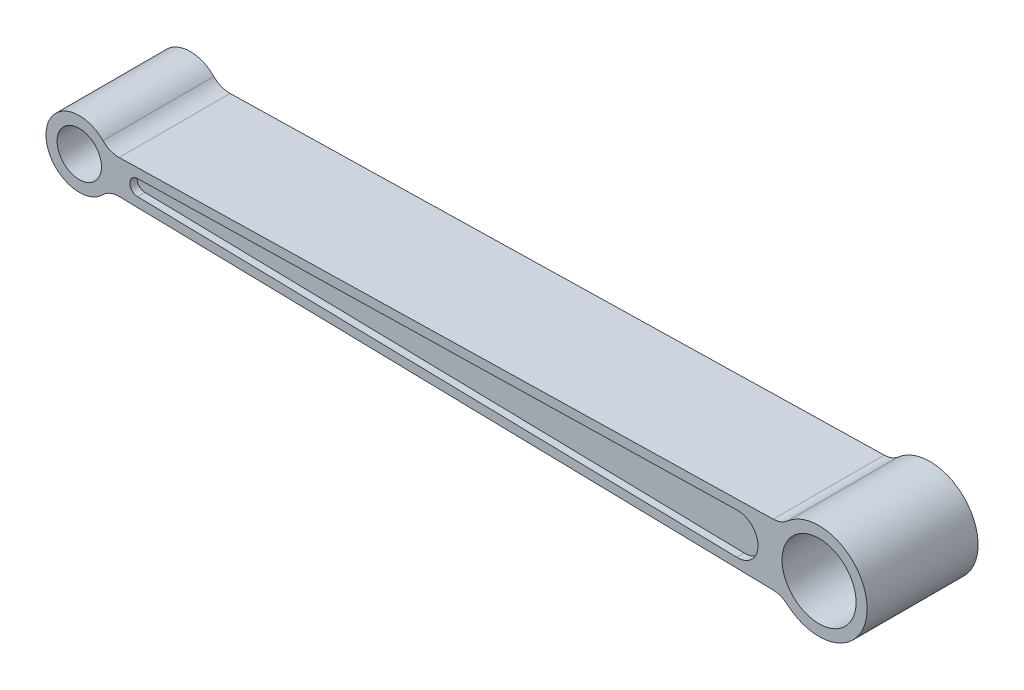
ISO-10303-21;
HEADER;
FILE_DESCRIPTION(('STEP AP214'),'2;1');
FILE_NAME('part.step','',(''),(''),'','','');
FILE_SCHEMA(('AUTOMOTIVE_DESIGN { 1 0 10303 214 1 1 1 1 }'));
ENDSEC;
DATA;
#1=APPLICATION_CONTEXT('core data for automotive mechanical design processes');
#2=APPLICATION_PROTOCOL_DEFINITION('international standard','automotive_design',2000,#1);
#3=PRODUCT_CONTEXT('',#1,'mechanical');
#4=PRODUCT('Part','Part','',(#3));
#5=PRODUCT_RELATED_PRODUCT_CATEGORY('part','',(#4));
#6=PRODUCT_DEFINITION_FORMATION('','',#4);
#7=PRODUCT_DEFINITION_CONTEXT('part definition',#1,'design');
#8=PRODUCT_DEFINITION('design','',#6,#7);
#9=PRODUCT_DEFINITION_SHAPE('','',#8);
#10=(LENGTH_UNIT() NAMED_UNIT(*) SI_UNIT(.MILLI.,.METRE.));
#11=(NAMED_UNIT(*) PLANE_ANGLE_UNIT() SI_UNIT($,.RADIAN.));
#12=(NAMED_UNIT(*) SI_UNIT($,.STERADIAN.) SOLID_ANGLE_UNIT());
#13=UNCERTAINTY_MEASURE_WITH_UNIT(LENGTH_MEASURE(1.E-05),#10,'distance_accuracy_value','');
#14=(GEOMETRIC_REPRESENTATION_CONTEXT(3) GLOBAL_UNCERTAINTY_ASSIGNED_CONTEXT((#13)) GLOBAL_UNIT_ASSIGNED_CONTEXT((#10,
#11,#12)) REPRESENTATION_CONTEXT('',''));
#15=CARTESIAN_POINT('',(0.,0.,0.));
#16=DIRECTION('',(0.,0.,1.));
#17=DIRECTION('',(1.,0.,0.));
#18=AXIS2_PLACEMENT_3D('',#15,#16,#17);
#19=CARTESIAN_POINT('',(-0.0188833196937545,-0.892432260097631,7.5));
#20=DIRECTION('',(0.0211546519999597,0.999776215309586,0.));
#21=DIRECTION('',(-0.999776215309586,0.0211546519999597,0.));
#22=AXIS2_PLACEMENT_3D('',#19,#20,#21);
#23=PLANE('',#22);
#24=DIRECTION('',(0.,0.,-1.));
#25=VECTOR('',#24,1.);
#26=CARTESIAN_POINT('',(7.88368043257852,-1.05964566598472,7.5));
#27=LINE('',#26,#25);
#28=CARTESIAN_POINT('',(7.88368043257852,-1.05964566598472,-6.5));
#29=VERTEX_POINT('',#28);
#30=CARTESIAN_POINT('',(7.88368043257852,-1.05964566598472,-7.5));
#31=VERTEX_POINT('',#30);
#32=EDGE_CURVE('E274',#29,#31,#27,.T.);
#33=ORIENTED_EDGE('',*,*,#32,.F.);
#34=DIRECTION('',(0.999776215309587,-0.0211546519999597,0.));
#35=VECTOR('',#34,1.);
#36=CARTESIAN_POINT('',(-0.0188833196937545,-0.892432260097631,-6.5));
#37=LINE('',#36,#35);
#38=CARTESIAN_POINT('',(88.8559527051768,-2.77296932316172,-6.5));
#39=VERTEX_POINT('',#38);
#40=EDGE_CURVE('E197',#29,#39,#37,.T.);
#41=ORIENTED_EDGE('',*,*,#40,.T.);
#42=DIRECTION('',(0.,0.,-1.));
#43=VECTOR('',#42,1.);
#44=CARTESIAN_POINT('',(88.8559527051768,-2.77296932316172,7.5));
#45=LINE('',#44,#43);
#46=CARTESIAN_POINT('',(88.8559527051768,-2.77296932316172,-7.5));
#47=VERTEX_POINT('',#46);
#48=EDGE_CURVE('E278',#39,#47,#45,.T.);
#49=ORIENTED_EDGE('',*,*,#48,.T.);
#50=DIRECTION('',(0.999776215309587,-0.0211546519999597,0.));
#51=VECTOR('',#50,1.);
#52=CARTESIAN_POINT('',(-0.0188833196937545,-0.892432260097631,-7.5));
#53=LINE('',#52,#51);
#54=EDGE_CURVE('E240',#31,#47,#53,.T.);
#55=ORIENTED_EDGE('',*,*,#54,.F.);
#56=EDGE_LOOP('',(#33,#41,#49,#55));
#57=FACE_BOUND('',#56,.T.);
#58=ADVANCED_FACE('F38',(#57),#23,.T.);
#59=CARTESIAN_POINT('',(7.88368043257851,0.,7.5));
#60=DIRECTION('',(0.,0.,-1.));
#61=DIRECTION('',(-1.,0.,0.));
#62=AXIS2_PLACEMENT_3D('',#59,#60,#61);
#63=CYLINDRICAL_SURFACE('',#62,1.05964566598483);
#64=DIRECTION('',(0.,0.,-1.));
#65=VECTOR('',#64,1.);
#66=CARTESIAN_POINT('',(7.88368043257851,1.05964566598495,7.5));
#67=LINE('',#66,#65);
#68=CARTESIAN_POINT('',(7.88368043257851,1.05964566598495,-6.5));
#69=VERTEX_POINT('',#68);
#70=CARTESIAN_POINT('',(7.88368043257851,1.05964566598495,-7.5));
#71=VERTEX_POINT('',#70);
#72=EDGE_CURVE('E269',#69,#71,#67,.T.);
#73=ORIENTED_EDGE('',*,*,#72,.F.);
#74=CARTESIAN_POINT('',(7.88368043257851,0.,-6.5));
#75=DIRECTION('',(0.,0.,1.));
#76=DIRECTION('',(1.,0.,0.));
#77=AXIS2_PLACEMENT_3D('',#74,#75,#76);
#78=CIRCLE('',#77,1.05964566598483);
#79=EDGE_CURVE('E175',#69,#29,#78,.T.);
#80=ORIENTED_EDGE('',*,*,#79,.T.);
#81=ORIENTED_EDGE('',*,*,#32,.T.);
#82=CARTESIAN_POINT('',(7.88368043257851,0.,-7.5));
#83=DIRECTION('',(0.,0.,1.));
#84=DIRECTION('',(1.,0.,0.));
#85=AXIS2_PLACEMENT_3D('',#82,#83,#84);
#86=CIRCLE('',#85,1.05964566598483);
#87=EDGE_CURVE('E243',#71,#31,#86,.T.);
#88=ORIENTED_EDGE('',*,*,#87,.F.);
#89=EDGE_LOOP('',(#73,#80,#81,#88));
#90=FACE_BOUND('',#89,.T.);
#91=ADVANCED_FACE('F359',(#90),#63,.F.);
#92=CARTESIAN_POINT('',(-0.0188833196937573,0.892432260097883,7.5));
#93=DIRECTION('',(-0.0211546519999568,0.999776215309586,0.));
#94=DIRECTION('',(-0.999776215309586,-0.0211546519999568,0.));
#95=AXIS2_PLACEMENT_3D('',#92,#93,#94);
#96=PLANE('',#95);
#97=DIRECTION('',(0.999776215309587,0.0211546519999568,0.));
#98=VECTOR('',#97,1.);
#99=CARTESIAN_POINT('',(-0.0188833196937573,0.892432260097883,-6.5));
#100=LINE('',#99,#98);
#101=CARTESIAN_POINT('',(88.8559527051768,2.77296932316172,-6.5));
#102=VERTEX_POINT('',#101);
#103=EDGE_CURVE('E202',#69,#102,#100,.T.);
#104=ORIENTED_EDGE('',*,*,#103,.F.);
#105=ORIENTED_EDGE('',*,*,#72,.T.);
#106=DIRECTION('',(0.999776215309587,0.0211546519999568,0.));
#107=VECTOR('',#106,1.);
#108=CARTESIAN_POINT('',(-0.0188833196937573,0.892432260097883,-7.5));
#109=LINE('',#108,#107);
#110=CARTESIAN_POINT('',(88.8559527051768,2.77296932316172,-7.5));
#111=VERTEX_POINT('',#110);
#112=EDGE_CURVE('E246',#71,#111,#109,.T.);
#113=ORIENTED_EDGE('',*,*,#112,.T.);
#114=DIRECTION('',(0.,0.,-1.));
#115=VECTOR('',#114,1.);
#116=CARTESIAN_POINT('',(88.8559527051768,2.77296932316172,7.5));
#117=LINE('',#116,#115);
#118=EDGE_CURVE('E237',#102,#111,#117,.T.);
#119=ORIENTED_EDGE('',*,*,#118,.F.);
#120=EDGE_LOOP('',(#104,#105,#113,#119));
#121=FACE_BOUND('',#120,.T.);
#122=ADVANCED_FACE('F366',(#121),#96,.F.);
#123=CARTESIAN_POINT('',(-0.0458432814275866,-2.16656943367056,7.5));
#124=DIRECTION('',(0.0211546519999571,0.999776215309586,0.));
#125=DIRECTION('',(-0.999776215309586,0.0211546519999571,0.));
#126=AXIS2_PLACEMENT_3D('',#123,#124,#125);
#127=PLANE('',#126);
#128=DIRECTION('',(0.999776215309587,-0.0211546519999571,0.));
#129=VECTOR('',#128,1.);
#130=CARTESIAN_POINT('',(-0.0458432814275866,-2.16656943367056,-7.5));
#131=LINE('',#130,#129);
#132=CARTESIAN_POINT('',(5.38907383574148,-2.28156894906383,-7.5));
#133=VERTEX_POINT('',#132);
#134=CARTESIAN_POINT('',(93.8103676454789,-4.15250933681024,-7.5));
#135=VERTEX_POINT('',#134);
#136=EDGE_CURVE('E249',#133,#135,#131,.T.);
#137=ORIENTED_EDGE('',*,*,#136,.T.);
#138=DIRECTION('',(0.,0.,1.));
#139=VECTOR('',#138,1.);
#140=CARTESIAN_POINT('',(93.8103676454788,-4.15250933681024,7.5));
#141=LINE('',#140,#139);
#142=CARTESIAN_POINT('',(93.8103676454789,-4.15250933681024,7.5));
#143=VERTEX_POINT('',#142);
#144=EDGE_CURVE('E290',#135,#143,#141,.T.);
#145=ORIENTED_EDGE('',*,*,#144,.T.);
#146=DIRECTION('',(0.999776215309587,-0.0211546519999571,0.));
#147=VECTOR('',#146,1.);
#148=CARTESIAN_POINT('',(-0.0458432814275866,-2.16656943367056,7.5));
#149=LINE('',#148,#147);
#150=CARTESIAN_POINT('',(5.38907383574148,-2.28156894906383,7.5));
#151=VERTEX_POINT('',#150);
#152=EDGE_CURVE('E221',#151,#143,#149,.T.);
#153=ORIENTED_EDGE('',*,*,#152,.F.);
#154=DIRECTION('',(0.,0.,1.));
#155=VECTOR('',#154,1.);
#156=CARTESIAN_POINT('',(5.38907383574148,-2.28156894906383,-7.5));
#157=LINE('',#156,#155);
#158=EDGE_CURVE('E287',#151,#133,#157,.F.);
#159=ORIENTED_EDGE('',*,*,#158,.T.);
#160=EDGE_LOOP('',(#137,#145,#153,#159));
#161=FACE_BOUND('',#160,.T.);
#162=ADVANCED_FACE('F342',(#161),#127,.F.);
#163=CARTESIAN_POINT('',(100.,0.,7.5));
#164=DIRECTION('',(0.,0.,-1.));
#165=DIRECTION('',(-1.,0.,0.));
#166=AXIS2_PLACEMENT_3D('',#163,#164,#165);
#167=CYLINDRICAL_SURFACE('',#166,6.5);
#168=CARTESIAN_POINT('',(100.,0.,7.5));
#169=DIRECTION('',(0.,0.,1.));
#170=DIRECTION('',(1.,0.,0.));
#171=AXIS2_PLACEMENT_3D('',#168,#169,#170);
#172=CIRCLE('',#171,6.5);
#173=CARTESIAN_POINT('',(95.7215656822751,-4.8933628302951,7.5));
#174=VERTEX_POINT('',#173);
#175=CARTESIAN_POINT('',(95.7215656822751,4.8933628302951,7.5));
#176=VERTEX_POINT('',#175);
#177=EDGE_CURVE('E224',#174,#176,#172,.T.);
#178=ORIENTED_EDGE('',*,*,#177,.F.);
#179=DIRECTION('',(0.,0.,-1.));
#180=VECTOR('',#179,1.);
#181=CARTESIAN_POINT('',(95.7215656822751,-4.8933628302951,7.5));
#182=LINE('',#181,#180);
#183=CARTESIAN_POINT('',(95.7215656822751,-4.8933628302951,-7.5));
#184=VERTEX_POINT('',#183);
#185=EDGE_CURVE('E284',#174,#184,#182,.T.);
#186=ORIENTED_EDGE('',*,*,#185,.T.);
#187=CARTESIAN_POINT('',(100.,0.,-7.5));
#188=DIRECTION('',(0.,0.,1.));
#189=DIRECTION('',(1.,0.,0.));
#190=AXIS2_PLACEMENT_3D('',#187,#188,#189);
#191=CIRCLE('',#190,6.5);
#192=CARTESIAN_POINT('',(95.7215656822751,4.8933628302951,-7.5));
#193=VERTEX_POINT('',#192);
#194=EDGE_CURVE('E252',#184,#193,#191,.T.);
#195=ORIENTED_EDGE('',*,*,#194,.T.);
#196=DIRECTION('',(0.,0.,-1.));
#197=VECTOR('',#196,1.);
#198=CARTESIAN_POINT('',(95.7215656822751,4.8933628302951,7.5));
#199=LINE('',#198,#197);
#200=EDGE_CURVE('E282',#193,#176,#199,.F.);
#201=ORIENTED_EDGE('',*,*,#200,.T.);
#202=EDGE_LOOP('',(#178,#186,#195,#201));
#203=FACE_BOUND('',#202,.T.);
#204=ADVANCED_FACE('F322',(#203),#167,.T.);
#205=CARTESIAN_POINT('',(-0.0458432814275862,2.16656943367057,7.5));
#206=DIRECTION('',(-0.0211546519999569,0.999776215309586,0.));
#207=DIRECTION('',(-0.999776215309586,-0.0211546519999569,0.));
#208=AXIS2_PLACEMENT_3D('',#205,#206,#207);
#209=PLANE('',#208);
#210=DIRECTION('',(0.999776215309587,0.0211546519999569,0.));
#211=VECTOR('',#210,1.);
#212=CARTESIAN_POINT('',(-0.0458432814275862,2.16656943367057,-7.5));
#213=LINE('',#212,#211);
#214=CARTESIAN_POINT('',(5.38907383574148,2.28156894906384,-7.5));
#215=VERTEX_POINT('',#214);
#216=CARTESIAN_POINT('',(93.8103676454788,4.15250933681022,-7.5));
#217=VERTEX_POINT('',#216);
#218=EDGE_CURVE('E255',#215,#217,#213,.T.);
#219=ORIENTED_EDGE('',*,*,#218,.F.);
#220=DIRECTION('',(0.,0.,-1.));
#221=VECTOR('',#220,1.);
#222=CARTESIAN_POINT('',(5.38907383574148,2.28156894906384,7.5));
#223=LINE('',#222,#221);
#224=CARTESIAN_POINT('',(5.38907383574148,2.28156894906384,7.5));
#225=VERTEX_POINT('',#224);
#226=EDGE_CURVE('E58',#215,#225,#223,.F.);
#227=ORIENTED_EDGE('',*,*,#226,.T.);
#228=DIRECTION('',(0.999776215309587,0.0211546519999569,0.));
#229=VECTOR('',#228,1.);
#230=CARTESIAN_POINT('',(-0.0458432814275862,2.16656943367057,7.5));
#231=LINE('',#230,#229);
#232=CARTESIAN_POINT('',(93.8103676454788,4.15250933681022,7.5));
#233=VERTEX_POINT('',#232);
#234=EDGE_CURVE('E226',#225,#233,#231,.T.);
#235=ORIENTED_EDGE('',*,*,#234,.T.);
#236=DIRECTION('',(0.,0.,-1.));
#237=VECTOR('',#236,1.);
#238=CARTESIAN_POINT('',(93.8103676454788,4.15250933681022,7.5));
#239=LINE('',#238,#237);
#240=EDGE_CURVE('E297',#233,#217,#239,.T.);
#241=ORIENTED_EDGE('',*,*,#240,.T.);
#242=EDGE_LOOP('',(#219,#227,#235,#241));
#243=FACE_BOUND('',#242,.T.);
#244=ADVANCED_FACE('F324',(#243),#209,.T.);
#245=CARTESIAN_POINT('',(88.9733539309243,0.,7.5));
#246=DIRECTION('',(0.,0.,-1.));
#247=DIRECTION('',(-1.,0.,0.));
#248=AXIS2_PLACEMENT_3D('',#245,#246,#247);
#249=CYLINDRICAL_SURFACE('',#248,2.77545346114882);
#250=CARTESIAN_POINT('',(88.9733539309243,0.,6.5));
#251=DIRECTION('',(0.,0.,1.));
#252=DIRECTION('',(1.,0.,0.));
#253=AXIS2_PLACEMENT_3D('',#250,#251,#252);
#254=CIRCLE('',#253,2.77545346114882);
#255=CARTESIAN_POINT('',(88.9733539309242,-2.77545346114882,6.5));
#256=VERTEX_POINT('',#255);
#257=CARTESIAN_POINT('',(88.9733539309242,2.77545346114882,6.5));
#258=VERTEX_POINT('',#257);
#259=EDGE_CURVE('E169',#256,#258,#254,.T.);
#260=ORIENTED_EDGE('',*,*,#259,.F.);
#261=DIRECTION('',(0.,0.,-1.));
#262=VECTOR('',#261,1.);
#263=CARTESIAN_POINT('',(88.9733539309242,-2.77545346114882,6.5));
#264=LINE('',#263,#262);
#265=CARTESIAN_POINT('',(88.9733539309242,-2.77545346114882,-6.5));
#266=VERTEX_POINT('',#265);
#267=EDGE_CURVE('E178',#256,#266,#264,.T.);
#268=ORIENTED_EDGE('',*,*,#267,.T.);
#269=CARTESIAN_POINT('',(88.9733539309243,0.,-6.5));
#270=DIRECTION('',(0.,0.,1.));
#271=DIRECTION('',(1.,0.,0.));
#272=AXIS2_PLACEMENT_3D('',#269,#270,#271);
#273=CIRCLE('',#272,2.77545346114882);
#274=CARTESIAN_POINT('',(88.973353930924,2.77545346114882,-6.5));
#275=VERTEX_POINT('',#274);
#276=EDGE_CURVE('E199',#266,#275,#273,.T.);
#277=ORIENTED_EDGE('',*,*,#276,.T.);
#278=DIRECTION('',(0.,0.,-1.));
#279=VECTOR('',#278,1.);
#280=CARTESIAN_POINT('',(88.9733539309242,2.77545346114882,6.5));
#281=LINE('',#280,#279);
#282=EDGE_CURVE('E186',#258,#275,#281,.T.);
#283=ORIENTED_EDGE('',*,*,#282,.F.);
#284=EDGE_LOOP('',(#260,#268,#277,#283));
#285=FACE_BOUND('',#284,.T.);
#286=CARTESIAN_POINT('',(88.9733539309243,0.,-7.5));
#287=DIRECTION('',(0.,0.,1.));
#288=DIRECTION('',(1.,0.,0.));
#289=AXIS2_PLACEMENT_3D('',#286,#287,#288);
#290=CIRCLE('',#289,2.77545346114882);
#291=EDGE_CURVE('E208',#47,#111,#290,.T.);
#292=ORIENTED_EDGE('',*,*,#291,.F.);
#293=ORIENTED_EDGE('',*,*,#48,.F.);
#294=DIRECTION('',(0.,0.,-1.));
#295=VECTOR('',#294,1.);
#296=CARTESIAN_POINT('',(88.8559527051768,-2.77296932316172,7.5));
#297=LINE('',#296,#295);
#298=CARTESIAN_POINT('',(88.8559527051768,-2.77296932316172,6.5));
#299=VERTEX_POINT('',#298);
#300=EDGE_CURVE('E185',#39,#299,#297,.F.);
#301=ORIENTED_EDGE('',*,*,#300,.T.);
#302=CARTESIAN_POINT('',(88.8559527051768,-2.77296932316172,7.5));
#303=VERTEX_POINT('',#302);
#304=EDGE_CURVE('E279',#303,#299,#45,.T.);
#305=ORIENTED_EDGE('',*,*,#304,.F.);
#306=CARTESIAN_POINT('',(88.9733539309243,0.,7.5));
#307=DIRECTION('',(0.,0.,1.));
#308=DIRECTION('',(1.,0.,0.));
#309=AXIS2_PLACEMENT_3D('',#306,#307,#308);
#310=CIRCLE('',#309,2.77545346114882);
#311=CARTESIAN_POINT('',(88.8559527051768,2.77296932316172,7.5));
#312=VERTEX_POINT('',#311);
#313=EDGE_CURVE('E209',#303,#312,#310,.T.);
#314=ORIENTED_EDGE('',*,*,#313,.T.);
#315=CARTESIAN_POINT('',(88.8559527051768,2.77296932316172,6.5));
#316=VERTEX_POINT('',#315);
#317=EDGE_CURVE('E266',#312,#316,#117,.T.);
#318=ORIENTED_EDGE('',*,*,#317,.T.);
#319=EDGE_CURVE('E270',#316,#102,#117,.T.);
#320=ORIENTED_EDGE('',*,*,#319,.T.);
#321=ORIENTED_EDGE('',*,*,#118,.T.);
#322=EDGE_LOOP('',(#292,#293,#301,#305,#314,#318,#320,#321));
#323=FACE_BOUND('',#322,.T.);
#324=ADVANCED_FACE('F188',(#285,#323),#249,.F.);
#325=DIRECTION('',(0.999776215309587,-0.0211546519999597,0.));
#326=VECTOR('',#325,1.);
#327=CARTESIAN_POINT('',(-0.0188833196937545,-0.892432260097631,6.5));
#328=LINE('',#327,#326);
#329=CARTESIAN_POINT('',(7.88368043257852,-1.05964566598472,6.5));
#330=VERTEX_POINT('',#329);
#331=EDGE_CURVE('E172',#330,#299,#328,.T.);
#332=ORIENTED_EDGE('',*,*,#331,.F.);
#333=CARTESIAN_POINT('',(7.88368043257852,-1.05964566598472,7.5));
#334=VERTEX_POINT('',#333);
#335=EDGE_CURVE('E275',#334,#330,#27,.T.);
#336=ORIENTED_EDGE('',*,*,#335,.F.);
#337=DIRECTION('',(0.999776215309587,-0.0211546519999597,0.));
#338=VECTOR('',#337,1.);
#339=CARTESIAN_POINT('',(-0.0188833196937545,-0.892432260097631,7.5));
#340=LINE('',#339,#338);
#341=EDGE_CURVE('E212',#334,#303,#340,.T.);
#342=ORIENTED_EDGE('',*,*,#341,.T.);
#343=ORIENTED_EDGE('',*,*,#304,.T.);
#344=EDGE_LOOP('',(#332,#336,#342,#343));
#345=FACE_BOUND('',#344,.T.);
#346=ADVANCED_FACE('F362',(#345),#23,.T.);
#347=CARTESIAN_POINT('',(7.88368043257851,0.,6.5));
#348=DIRECTION('',(0.,0.,1.));
#349=DIRECTION('',(1.,0.,0.));
#350=AXIS2_PLACEMENT_3D('',#347,#348,#349);
#351=CIRCLE('',#350,1.05964566598483);
#352=CARTESIAN_POINT('',(7.88368043257851,1.05964566598495,6.5));
#353=VERTEX_POINT('',#352);
#354=EDGE_CURVE('E195',#353,#330,#351,.T.);
#355=ORIENTED_EDGE('',*,*,#354,.F.);
#356=CARTESIAN_POINT('',(7.88368043257851,1.05964566598495,7.5));
#357=VERTEX_POINT('',#356);
#358=EDGE_CURVE('E271',#357,#353,#67,.T.);
#359=ORIENTED_EDGE('',*,*,#358,.F.);
#360=CARTESIAN_POINT('',(7.88368043257851,0.,7.5));
#361=DIRECTION('',(0.,0.,1.));
#362=DIRECTION('',(1.,0.,0.));
#363=AXIS2_PLACEMENT_3D('',#360,#361,#362);
#364=CIRCLE('',#363,1.05964566598483);
#365=EDGE_CURVE('E216',#357,#334,#364,.T.);
#366=ORIENTED_EDGE('',*,*,#365,.T.);
#367=ORIENTED_EDGE('',*,*,#335,.T.);
#368=EDGE_LOOP('',(#355,#359,#366,#367));
#369=FACE_BOUND('',#368,.T.);
#370=ADVANCED_FACE('F369',(#369),#63,.F.);
#371=CARTESIAN_POINT('',(0.,0.,7.5));
#372=DIRECTION('',(0.,0.,-1.));
#373=DIRECTION('',(-1.,0.,0.));
#374=AXIS2_PLACEMENT_3D('',#371,#372,#373);
#375=CYLINDRICAL_SURFACE('',#374,3.);
#376=CARTESIAN_POINT('',(0.,0.,7.5));
#377=DIRECTION('',(0.,0.,1.));
#378=DIRECTION('',(1.,0.,0.));
#379=AXIS2_PLACEMENT_3D('',#376,#377,#378);
#380=CIRCLE('',#379,3.);
#381=CARTESIAN_POINT('',(3.,0.,7.5));
#382=VERTEX_POINT('',#381);
#383=EDGE_CURVE('E231',#382,#382,#380,.T.);
#384=ORIENTED_EDGE('',*,*,#383,.T.);
#385=EDGE_LOOP('',(#384));
#386=FACE_BOUND('',#385,.T.);
#387=CARTESIAN_POINT('',(0.,0.,-7.5));
#388=DIRECTION('',(0.,0.,1.));
#389=DIRECTION('',(1.,0.,0.));
#390=AXIS2_PLACEMENT_3D('',#387,#388,#389);
#391=CIRCLE('',#390,3.);
#392=CARTESIAN_POINT('',(3.,0.,-7.5));
#393=VERTEX_POINT('',#392);
#394=EDGE_CURVE('E261',#393,#393,#391,.T.);
#395=ORIENTED_EDGE('',*,*,#394,.F.);
#396=EDGE_LOOP('',(#395));
#397=FACE_BOUND('',#396,.T.);
#398=ADVANCED_FACE('F377',(#386,#397),#375,.F.);
#399=CARTESIAN_POINT('',(0.,0.,7.5));
#400=DIRECTION('',(0.,0.,-1.));
#401=DIRECTION('',(-1.,0.,0.));
#402=AXIS2_PLACEMENT_3D('',#399,#400,#401);
#403=CYLINDRICAL_SURFACE('',#402,4.5);
#404=CARTESIAN_POINT('',(0.,0.,-7.5));
#405=DIRECTION('',(0.,0.,1.));
#406=DIRECTION('',(1.,0.,0.));
#407=AXIS2_PLACEMENT_3D('',#404,#405,#406);
#408=CIRCLE('',#407,4.5);
#409=CARTESIAN_POINT('',(3.19536592784497,3.16853855699556,-7.5));
#410=VERTEX_POINT('',#409);
#411=CARTESIAN_POINT('',(3.19536592784497,-3.16853855699556,-7.5));
#412=VERTEX_POINT('',#411);
#413=EDGE_CURVE('E258',#410,#412,#408,.T.);
#414=ORIENTED_EDGE('',*,*,#413,.T.);
#415=DIRECTION('',(0.,0.,-1.));
#416=VECTOR('',#415,1.);
#417=CARTESIAN_POINT('',(3.19536592784497,-3.16853855699556,7.5));
#418=LINE('',#417,#416);
#419=CARTESIAN_POINT('',(3.19536592784497,-3.16853855699556,7.5));
#420=VERTEX_POINT('',#419);
#421=EDGE_CURVE('E295',#412,#420,#418,.F.);
#422=ORIENTED_EDGE('',*,*,#421,.T.);
#423=CARTESIAN_POINT('',(0.,0.,7.5));
#424=DIRECTION('',(0.,0.,1.));
#425=DIRECTION('',(1.,0.,0.));
#426=AXIS2_PLACEMENT_3D('',#423,#424,#425);
#427=CIRCLE('',#426,4.5);
#428=CARTESIAN_POINT('',(3.19536592784497,3.16853855699556,7.5));
#429=VERTEX_POINT('',#428);
#430=EDGE_CURVE('E228',#429,#420,#427,.T.);
#431=ORIENTED_EDGE('',*,*,#430,.F.);
#432=DIRECTION('',(0.,0.,-1.));
#433=VECTOR('',#432,1.);
#434=CARTESIAN_POINT('',(3.19536592784497,3.16853855699556,7.5));
#435=LINE('',#434,#433);
#436=EDGE_CURVE('E292',#429,#410,#435,.T.);
#437=ORIENTED_EDGE('',*,*,#436,.T.);
#438=EDGE_LOOP('',(#414,#422,#431,#437));
#439=FACE_BOUND('',#438,.T.);
#440=ADVANCED_FACE('F334',(#439),#403,.T.);
#441=ORIENTED_EDGE('',*,*,#358,.T.);
#442=DIRECTION('',(0.999776215309587,0.0211546519999568,0.));
#443=VECTOR('',#442,1.);
#444=CARTESIAN_POINT('',(-0.0188833196937573,0.892432260097883,6.5));
#445=LINE('',#444,#443);
#446=EDGE_CURVE('E192',#353,#316,#445,.T.);
#447=ORIENTED_EDGE('',*,*,#446,.T.);
#448=ORIENTED_EDGE('',*,*,#317,.F.);
#449=DIRECTION('',(0.999776215309587,0.0211546519999568,0.));
#450=VECTOR('',#449,1.);
#451=CARTESIAN_POINT('',(-0.0188833196937573,0.892432260097883,7.5));
#452=LINE('',#451,#450);
#453=EDGE_CURVE('E219',#357,#312,#452,.T.);
#454=ORIENTED_EDGE('',*,*,#453,.F.);
#455=EDGE_LOOP('',(#441,#447,#448,#454));
#456=FACE_BOUND('',#455,.T.);
#457=ADVANCED_FACE('F384',(#456),#96,.F.);
#458=CARTESIAN_POINT('',(100.,0.,7.5));
#459=DIRECTION('',(0.,0.,-1.));
#460=DIRECTION('',(-1.,0.,0.));
#461=AXIS2_PLACEMENT_3D('',#458,#459,#460);
#462=CYLINDRICAL_SURFACE('',#461,5.);
#463=CARTESIAN_POINT('',(100.,0.,7.5));
#464=DIRECTION('',(0.,0.,1.));
#465=DIRECTION('',(1.,0.,0.));
#466=AXIS2_PLACEMENT_3D('',#463,#464,#465);
#467=CIRCLE('',#466,5.);
#468=CARTESIAN_POINT('',(105.,0.,7.5));
#469=VERTEX_POINT('',#468);
#470=EDGE_CURVE('E234',#469,#469,#467,.T.);
#471=ORIENTED_EDGE('',*,*,#470,.T.);
#472=EDGE_LOOP('',(#471));
#473=FACE_BOUND('',#472,.T.);
#474=CARTESIAN_POINT('',(100.,0.,-7.5));
#475=DIRECTION('',(0.,0.,1.));
#476=DIRECTION('',(1.,0.,0.));
#477=AXIS2_PLACEMENT_3D('',#474,#475,#476);
#478=CIRCLE('',#477,5.);
#479=CARTESIAN_POINT('',(105.,0.,-7.5));
#480=VERTEX_POINT('',#479);
#481=EDGE_CURVE('E213',#480,#480,#478,.T.);
#482=ORIENTED_EDGE('',*,*,#481,.F.);
#483=EDGE_LOOP('',(#482));
#484=FACE_BOUND('',#483,.T.);
#485=ADVANCED_FACE('F405',(#473,#484),#462,.F.);
#486=CARTESIAN_POINT('',(0.,0.,7.5));
#487=DIRECTION('',(0.,0.,1.));
#488=DIRECTION('',(1.,0.,0.));
#489=AXIS2_PLACEMENT_3D('',#486,#487,#488);
#490=PLANE('',#489);
#491=ORIENTED_EDGE('',*,*,#313,.F.);
#492=ORIENTED_EDGE('',*,*,#341,.F.);
#493=ORIENTED_EDGE('',*,*,#365,.F.);
#494=ORIENTED_EDGE('',*,*,#453,.T.);
#495=EDGE_LOOP('',(#491,#492,#493,#494));
#496=FACE_BOUND('',#495,.T.);
#497=ORIENTED_EDGE('',*,*,#430,.T.);
#498=CARTESIAN_POINT('',(5.32560987974161,-5.28089759499259,7.5));
#499=DIRECTION('',(0.,0.,1.));
#500=DIRECTION('',(1.,0.,0.));
#501=AXIS2_PLACEMENT_3D('',#498,#499,#500);
#502=CIRCLE('',#501,3.);
#503=EDGE_CURVE('E307',#420,#151,#502,.F.);
#504=ORIENTED_EDGE('',*,*,#503,.T.);
#505=ORIENTED_EDGE('',*,*,#152,.T.);
#506=CARTESIAN_POINT('',(93.746903689479,-7.151837982739,7.5));
#507=DIRECTION('',(0.,0.,1.));
#508=DIRECTION('',(1.,0.,0.));
#509=AXIS2_PLACEMENT_3D('',#506,#507,#508);
#510=CIRCLE('',#509,3.);
#511=EDGE_CURVE('E303',#143,#174,#510,.F.);
#512=ORIENTED_EDGE('',*,*,#511,.T.);
#513=ORIENTED_EDGE('',*,*,#177,.T.);
#514=CARTESIAN_POINT('',(93.746903689479,7.15183798273898,7.5));
#515=DIRECTION('',(0.,0.,1.));
#516=DIRECTION('',(1.,0.,0.));
#517=AXIS2_PLACEMENT_3D('',#514,#515,#516);
#518=CIRCLE('',#517,3.);
#519=EDGE_CURVE('E11',#176,#233,#518,.F.);
#520=ORIENTED_EDGE('',*,*,#519,.T.);
#521=ORIENTED_EDGE('',*,*,#234,.F.);
#522=CARTESIAN_POINT('',(5.32560987974161,5.28089759499259,7.5));
#523=DIRECTION('',(0.,0.,1.));
#524=DIRECTION('',(1.,0.,0.));
#525=AXIS2_PLACEMENT_3D('',#522,#523,#524);
#526=CIRCLE('',#525,3.);
#527=EDGE_CURVE('E311',#225,#429,#526,.F.);
#528=ORIENTED_EDGE('',*,*,#527,.T.);
#529=EDGE_LOOP('',(#497,#504,#505,#512,#513,#520,#521,#528));
#530=FACE_BOUND('',#529,.T.);
#531=ORIENTED_EDGE('',*,*,#383,.F.);
#532=EDGE_LOOP('',(#531));
#533=FACE_BOUND('',#532,.T.);
#534=ORIENTED_EDGE('',*,*,#470,.F.);
#535=EDGE_LOOP('',(#534));
#536=FACE_BOUND('',#535,.T.);
#537=ADVANCED_FACE('F326',(#496,#530,#533,#536),#490,.T.);
#538=CARTESIAN_POINT('',(0.,0.,-7.5));
#539=DIRECTION('',(0.,0.,1.));
#540=DIRECTION('',(1.,0.,0.));
#541=AXIS2_PLACEMENT_3D('',#538,#539,#540);
#542=PLANE('',#541);
#543=ORIENTED_EDGE('',*,*,#291,.T.);
#544=ORIENTED_EDGE('',*,*,#112,.F.);
#545=ORIENTED_EDGE('',*,*,#87,.T.);
#546=ORIENTED_EDGE('',*,*,#54,.T.);
#547=EDGE_LOOP('',(#543,#544,#545,#546));
#548=FACE_BOUND('',#547,.T.);
#549=ORIENTED_EDGE('',*,*,#136,.F.);
#550=CARTESIAN_POINT('',(5.32560987974161,-5.28089759499259,-7.5));
#551=DIRECTION('',(0.,0.,1.));
#552=DIRECTION('',(1.,0.,0.));
#553=AXIS2_PLACEMENT_3D('',#550,#551,#552);
#554=CIRCLE('',#553,3.);
#555=EDGE_CURVE('E305',#133,#412,#554,.T.);
#556=ORIENTED_EDGE('',*,*,#555,.T.);
#557=ORIENTED_EDGE('',*,*,#413,.F.);
#558=CARTESIAN_POINT('',(5.32560987974161,5.28089759499259,-7.5));
#559=DIRECTION('',(0.,0.,1.));
#560=DIRECTION('',(1.,0.,0.));
#561=AXIS2_PLACEMENT_3D('',#558,#559,#560);
#562=CIRCLE('',#561,3.);
#563=EDGE_CURVE('E309',#410,#215,#562,.T.);
#564=ORIENTED_EDGE('',*,*,#563,.T.);
#565=ORIENTED_EDGE('',*,*,#218,.T.);
#566=CARTESIAN_POINT('',(93.746903689479,7.15183798273898,-7.5));
#567=DIRECTION('',(0.,0.,1.));
#568=DIRECTION('',(1.,0.,0.));
#569=AXIS2_PLACEMENT_3D('',#566,#567,#568);
#570=CIRCLE('',#569,3.);
#571=EDGE_CURVE('E46',#217,#193,#570,.T.);
#572=ORIENTED_EDGE('',*,*,#571,.T.);
#573=ORIENTED_EDGE('',*,*,#194,.F.);
#574=CARTESIAN_POINT('',(93.746903689479,-7.151837982739,-7.5));
#575=DIRECTION('',(0.,0.,1.));
#576=DIRECTION('',(1.,0.,0.));
#577=AXIS2_PLACEMENT_3D('',#574,#575,#576);
#578=CIRCLE('',#577,3.);
#579=EDGE_CURVE('E301',#184,#135,#578,.T.);
#580=ORIENTED_EDGE('',*,*,#579,.T.);
#581=EDGE_LOOP('',(#549,#556,#557,#564,#565,#572,#573,#580));
#582=FACE_BOUND('',#581,.T.);
#583=ORIENTED_EDGE('',*,*,#394,.T.);
#584=EDGE_LOOP('',(#583));
#585=FACE_BOUND('',#584,.T.);
#586=ORIENTED_EDGE('',*,*,#481,.T.);
#587=EDGE_LOOP('',(#586));
#588=FACE_BOUND('',#587,.T.);
#589=ADVANCED_FACE('F315',(#548,#582,#585,#588),#542,.F.);
#590=CARTESIAN_POINT('',(-0.0188833196937545,-0.892432260097631,6.5));
#591=DIRECTION('',(0.0211546519999597,0.999776215309586,0.));
#592=DIRECTION('',(-0.999776215309586,0.0211546519999597,0.));
#593=AXIS2_PLACEMENT_3D('',#590,#591,#592);
#594=PLANE('',#593);
#595=ORIENTED_EDGE('',*,*,#300,.F.);
#596=EDGE_CURVE('E181',#39,#266,#37,.T.);
#597=ORIENTED_EDGE('',*,*,#596,.T.);
#598=ORIENTED_EDGE('',*,*,#267,.F.);
#599=EDGE_CURVE('E164',#299,#256,#328,.T.);
#600=ORIENTED_EDGE('',*,*,#599,.F.);
#601=EDGE_LOOP('',(#595,#597,#598,#600));
#602=FACE_BOUND('',#601,.T.);
#603=ADVANCED_FACE('F179',(#602),#594,.F.);
#604=CARTESIAN_POINT('',(-0.0188833196937573,0.892432260097883,6.5));
#605=DIRECTION('',(-0.0211546519999568,0.999776215309586,0.));
#606=DIRECTION('',(-0.999776215309586,-0.0211546519999568,0.));
#607=AXIS2_PLACEMENT_3D('',#604,#605,#606);
#608=PLANE('',#607);
#609=EDGE_CURVE('E201',#102,#275,#100,.T.);
#610=ORIENTED_EDGE('',*,*,#609,.F.);
#611=ORIENTED_EDGE('',*,*,#319,.F.);
#612=EDGE_CURVE('E190',#316,#258,#445,.T.);
#613=ORIENTED_EDGE('',*,*,#612,.T.);
#614=ORIENTED_EDGE('',*,*,#282,.T.);
#615=EDGE_LOOP('',(#610,#611,#613,#614));
#616=FACE_BOUND('',#615,.T.);
#617=ADVANCED_FACE('F392',(#616),#608,.T.);
#618=CARTESIAN_POINT('',(0.,0.,6.5));
#619=DIRECTION('',(0.,0.,1.));
#620=DIRECTION('',(1.,0.,0.));
#621=AXIS2_PLACEMENT_3D('',#618,#619,#620);
#622=PLANE('',#621);
#623=ORIENTED_EDGE('',*,*,#331,.T.);
#624=ORIENTED_EDGE('',*,*,#599,.T.);
#625=ORIENTED_EDGE('',*,*,#259,.T.);
#626=ORIENTED_EDGE('',*,*,#612,.F.);
#627=ORIENTED_EDGE('',*,*,#446,.F.);
#628=ORIENTED_EDGE('',*,*,#354,.T.);
#629=EDGE_LOOP('',(#623,#624,#625,#626,#627,#628));
#630=FACE_BOUND('',#629,.T.);
#631=ADVANCED_FACE('F166',(#630),#622,.T.);
#632=CARTESIAN_POINT('',(0.,0.,-6.5));
#633=DIRECTION('',(0.,0.,1.));
#634=DIRECTION('',(1.,0.,0.));
#635=AXIS2_PLACEMENT_3D('',#632,#633,#634);
#636=PLANE('',#635);
#637=ORIENTED_EDGE('',*,*,#40,.F.);
#638=ORIENTED_EDGE('',*,*,#79,.F.);
#639=ORIENTED_EDGE('',*,*,#103,.T.);
#640=ORIENTED_EDGE('',*,*,#609,.T.);
#641=ORIENTED_EDGE('',*,*,#276,.F.);
#642=ORIENTED_EDGE('',*,*,#596,.F.);
#643=EDGE_LOOP('',(#637,#638,#639,#640,#641,#642));
#644=FACE_BOUND('',#643,.T.);
#645=ADVANCED_FACE('F348',(#644),#636,.F.);
#646=CARTESIAN_POINT('',(93.746903689479,-7.151837982739,7.5));
#647=DIRECTION('',(0.,0.,-1.));
#648=DIRECTION('',(-1.,0.,0.));
#649=AXIS2_PLACEMENT_3D('',#646,#647,#648);
#650=CYLINDRICAL_SURFACE('',#649,3.);
#651=ORIENTED_EDGE('',*,*,#511,.F.);
#652=ORIENTED_EDGE('',*,*,#144,.F.);
#653=ORIENTED_EDGE('',*,*,#579,.F.);
#654=ORIENTED_EDGE('',*,*,#185,.F.);
#655=EDGE_LOOP('',(#651,#652,#653,#654));
#656=FACE_BOUND('',#655,.T.);
#657=ADVANCED_FACE('F346',(#656),#650,.F.);
#658=CARTESIAN_POINT('',(5.32560987974161,-5.28089759499259,7.5));
#659=DIRECTION('',(0.,0.,-1.));
#660=DIRECTION('',(-1.,0.,0.));
#661=AXIS2_PLACEMENT_3D('',#658,#659,#660);
#662=CYLINDRICAL_SURFACE('',#661,3.);
#663=ORIENTED_EDGE('',*,*,#503,.F.);
#664=ORIENTED_EDGE('',*,*,#421,.F.);
#665=ORIENTED_EDGE('',*,*,#555,.F.);
#666=ORIENTED_EDGE('',*,*,#158,.F.);
#667=EDGE_LOOP('',(#663,#664,#665,#666));
#668=FACE_BOUND('',#667,.T.);
#669=ADVANCED_FACE('F339',(#668),#662,.F.);
#670=CARTESIAN_POINT('',(5.32560987974161,5.28089759499259,7.5));
#671=DIRECTION('',(0.,0.,-1.));
#672=DIRECTION('',(-1.,0.,0.));
#673=AXIS2_PLACEMENT_3D('',#670,#671,#672);
#674=CYLINDRICAL_SURFACE('',#673,3.);
#675=ORIENTED_EDGE('',*,*,#527,.F.);
#676=ORIENTED_EDGE('',*,*,#226,.F.);
#677=ORIENTED_EDGE('',*,*,#563,.F.);
#678=ORIENTED_EDGE('',*,*,#436,.F.);
#679=EDGE_LOOP('',(#675,#676,#677,#678));
#680=FACE_BOUND('',#679,.T.);
#681=ADVANCED_FACE('F331',(#680),#674,.F.);
#682=CARTESIAN_POINT('',(93.746903689479,7.15183798273898,7.5));
#683=DIRECTION('',(0.,0.,-1.));
#684=DIRECTION('',(-1.,0.,0.));
#685=AXIS2_PLACEMENT_3D('',#682,#683,#684);
#686=CYLINDRICAL_SURFACE('',#685,3.);
#687=ORIENTED_EDGE('',*,*,#519,.F.);
#688=ORIENTED_EDGE('',*,*,#200,.F.);
#689=ORIENTED_EDGE('',*,*,#571,.F.);
#690=ORIENTED_EDGE('',*,*,#240,.F.);
#691=EDGE_LOOP('',(#687,#688,#689,#690));
#692=FACE_BOUND('',#691,.T.);
#693=ADVANCED_FACE('F40',(#692),#686,.F.);
#694=CLOSED_SHELL('',(#58,#91,#122,#162,#204,#244,#324,#346,#370,#398,#440,#457,#485,#537,#589,
#603,#617,#631,#645,#657,#669,#681,#693));
#695=MANIFOLD_SOLID_BREP('B2',#694);
#696=ADVANCED_BREP_SHAPE_REPRESENTATION('',(#18,#695),#14);
#697=SHAPE_DEFINITION_REPRESENTATION(#9,#696);
ENDSEC;
END-ISO-10303-21;
